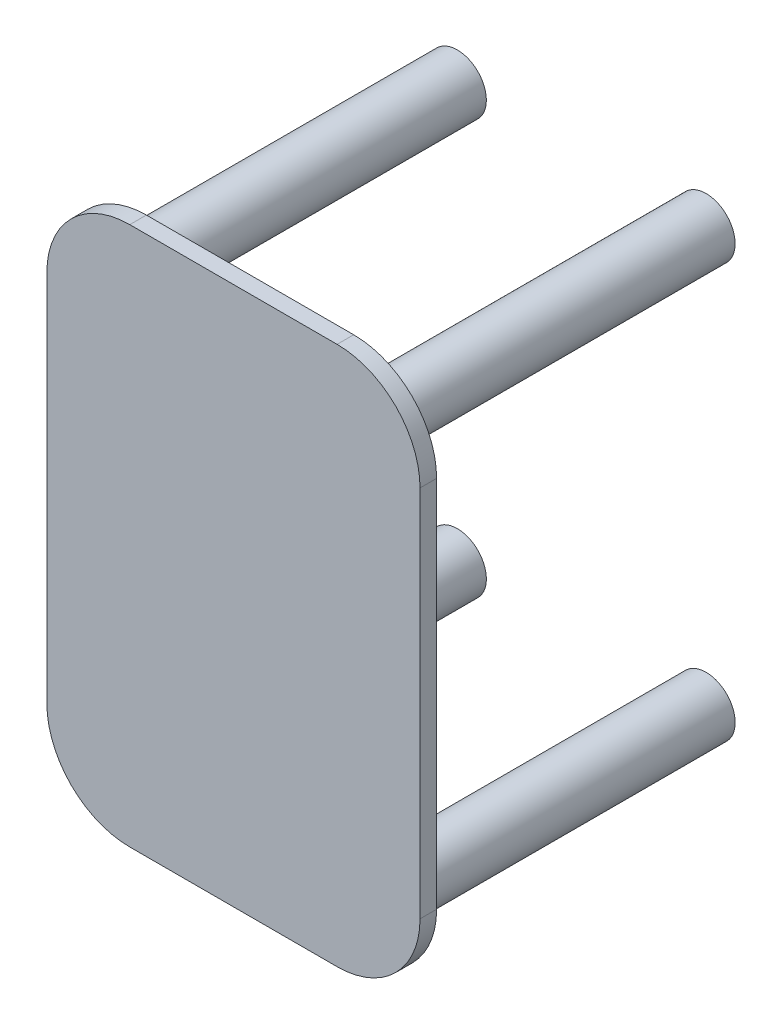
ISO-10303-21;
HEADER;
FILE_DESCRIPTION(('STEP AP214'),'2;1');
FILE_NAME('part.step','',(''),(''),'','','');
FILE_SCHEMA(('AUTOMOTIVE_DESIGN { 1 0 10303 214 1 1 1 1 }'));
ENDSEC;
DATA;
#1=APPLICATION_CONTEXT('core data for automotive mechanical design processes');
#2=APPLICATION_PROTOCOL_DEFINITION('international standard','automotive_design',2000,#1);
#3=PRODUCT_CONTEXT('',#1,'mechanical');
#4=PRODUCT('Part','Part','',(#3));
#5=PRODUCT_RELATED_PRODUCT_CATEGORY('part','',(#4));
#6=PRODUCT_DEFINITION_FORMATION('','',#4);
#7=PRODUCT_DEFINITION_CONTEXT('part definition',#1,'design');
#8=PRODUCT_DEFINITION('design','',#6,#7);
#9=PRODUCT_DEFINITION_SHAPE('','',#8);
#10=(LENGTH_UNIT() NAMED_UNIT(*) SI_UNIT(.MILLI.,.METRE.));
#11=(NAMED_UNIT(*) PLANE_ANGLE_UNIT() SI_UNIT($,.RADIAN.));
#12=(NAMED_UNIT(*) SI_UNIT($,.STERADIAN.) SOLID_ANGLE_UNIT());
#13=UNCERTAINTY_MEASURE_WITH_UNIT(LENGTH_MEASURE(1.E-05),#10,'distance_accuracy_value','');
#14=(GEOMETRIC_REPRESENTATION_CONTEXT(3) GLOBAL_UNCERTAINTY_ASSIGNED_CONTEXT((#13)) GLOBAL_UNIT_ASSIGNED_CONTEXT((#10,
#11,#12)) REPRESENTATION_CONTEXT('',''));
#15=CARTESIAN_POINT('',(0.,0.,0.));
#16=DIRECTION('',(0.,0.,1.));
#17=DIRECTION('',(1.,0.,0.));
#18=AXIS2_PLACEMENT_3D('',#15,#16,#17);
#19=CARTESIAN_POINT('',(-0.125,-0.225,0.42));
#20=DIRECTION('',(0.,0.,-1.));
#21=DIRECTION('',(-1.,0.,0.));
#22=AXIS2_PLACEMENT_3D('',#19,#20,#21);
#23=CYLINDRICAL_SURFACE('',#22,0.1);
#24=CARTESIAN_POINT('',(-0.125,-0.225,0.4));
#25=DIRECTION('',(0.,0.,1.));
#26=DIRECTION('',(1.,0.,0.));
#27=AXIS2_PLACEMENT_3D('',#24,#25,#26);
#28=CIRCLE('',#27,0.1);
#29=CARTESIAN_POINT('',(-0.225,-0.225,0.4));
#30=VERTEX_POINT('',#29);
#31=CARTESIAN_POINT('',(-0.125,-0.325,0.4));
#32=VERTEX_POINT('',#31);
#33=EDGE_CURVE('E138',#30,#32,#28,.T.);
#34=ORIENTED_EDGE('',*,*,#33,.T.);
#35=DIRECTION('',(0.,0.,-1.));
#36=VECTOR('',#35,1.);
#37=CARTESIAN_POINT('',(-0.125,-0.325,0.42));
#38=LINE('',#37,#36);
#39=CARTESIAN_POINT('',(-0.125,-0.325,0.42));
#40=VERTEX_POINT('',#39);
#41=EDGE_CURVE('E12',#40,#32,#38,.T.);
#42=ORIENTED_EDGE('',*,*,#41,.F.);
#43=CARTESIAN_POINT('',(-0.125,-0.225,0.42));
#44=DIRECTION('',(0.,0.,1.));
#45=DIRECTION('',(1.,0.,0.));
#46=AXIS2_PLACEMENT_3D('',#43,#44,#45);
#47=CIRCLE('',#46,0.1);
#48=CARTESIAN_POINT('',(-0.225,-0.225,0.42));
#49=VERTEX_POINT('',#48);
#50=EDGE_CURVE('E152',#49,#40,#47,.T.);
#51=ORIENTED_EDGE('',*,*,#50,.F.);
#52=DIRECTION('',(0.,0.,-1.));
#53=VECTOR('',#52,1.);
#54=CARTESIAN_POINT('',(-0.225,-0.225,0.42));
#55=LINE('',#54,#53);
#56=EDGE_CURVE('E134',#49,#30,#55,.T.);
#57=ORIENTED_EDGE('',*,*,#56,.T.);
#58=EDGE_LOOP('',(#34,#42,#51,#57));
#59=FACE_BOUND('',#58,.T.);
#60=ADVANCED_FACE('F42',(#59),#23,.T.);
#61=CARTESIAN_POINT('',(-0.125,-0.325,0.42));
#62=DIRECTION('',(0.,1.,0.));
#63=DIRECTION('',(0.,0.,1.));
#64=AXIS2_PLACEMENT_3D('',#61,#62,#63);
#65=PLANE('',#64);
#66=DIRECTION('',(1.,0.,0.));
#67=VECTOR('',#66,1.);
#68=CARTESIAN_POINT('',(-0.125,-0.325,0.4));
#69=LINE('',#68,#67);
#70=CARTESIAN_POINT('',(0.125,-0.325,0.4));
#71=VERTEX_POINT('',#70);
#72=EDGE_CURVE('E141',#32,#71,#69,.T.);
#73=ORIENTED_EDGE('',*,*,#72,.T.);
#74=DIRECTION('',(0.,0.,-1.));
#75=VECTOR('',#74,1.);
#76=CARTESIAN_POINT('',(0.125,-0.325,0.42));
#77=LINE('',#76,#75);
#78=CARTESIAN_POINT('',(0.125,-0.325,0.42));
#79=VERTEX_POINT('',#78);
#80=EDGE_CURVE('E50',#79,#71,#77,.T.);
#81=ORIENTED_EDGE('',*,*,#80,.F.);
#82=DIRECTION('',(1.,0.,0.));
#83=VECTOR('',#82,1.);
#84=CARTESIAN_POINT('',(-0.125,-0.325,0.42));
#85=LINE('',#84,#83);
#86=EDGE_CURVE('E101',#40,#79,#85,.T.);
#87=ORIENTED_EDGE('',*,*,#86,.F.);
#88=ORIENTED_EDGE('',*,*,#41,.T.);
#89=EDGE_LOOP('',(#73,#81,#87,#88));
#90=FACE_BOUND('',#89,.T.);
#91=ADVANCED_FACE('F187',(#90),#65,.F.);
#92=CARTESIAN_POINT('',(0.125,-0.225,0.42));
#93=DIRECTION('',(0.,0.,-1.));
#94=DIRECTION('',(-1.,0.,0.));
#95=AXIS2_PLACEMENT_3D('',#92,#93,#94);
#96=CYLINDRICAL_SURFACE('',#95,0.1);
#97=CARTESIAN_POINT('',(0.125,-0.225,0.4));
#98=DIRECTION('',(0.,0.,1.));
#99=DIRECTION('',(1.,0.,0.));
#100=AXIS2_PLACEMENT_3D('',#97,#98,#99);
#101=CIRCLE('',#100,0.1);
#102=CARTESIAN_POINT('',(0.225,-0.225,0.4));
#103=VERTEX_POINT('',#102);
#104=EDGE_CURVE('E143',#71,#103,#101,.T.);
#105=ORIENTED_EDGE('',*,*,#104,.T.);
#106=DIRECTION('',(0.,0.,-1.));
#107=VECTOR('',#106,1.);
#108=CARTESIAN_POINT('',(0.225,-0.225,0.42));
#109=LINE('',#108,#107);
#110=CARTESIAN_POINT('',(0.225,-0.225,0.42));
#111=VERTEX_POINT('',#110);
#112=EDGE_CURVE('E159',#111,#103,#109,.T.);
#113=ORIENTED_EDGE('',*,*,#112,.F.);
#114=CARTESIAN_POINT('',(0.125,-0.225,0.42));
#115=DIRECTION('',(0.,0.,1.));
#116=DIRECTION('',(1.,0.,0.));
#117=AXIS2_PLACEMENT_3D('',#114,#115,#116);
#118=CIRCLE('',#117,0.1);
#119=EDGE_CURVE('E167',#79,#111,#118,.T.);
#120=ORIENTED_EDGE('',*,*,#119,.F.);
#121=ORIENTED_EDGE('',*,*,#80,.T.);
#122=EDGE_LOOP('',(#105,#113,#120,#121));
#123=FACE_BOUND('',#122,.T.);
#124=ADVANCED_FACE('F165',(#123),#96,.T.);
#125=CARTESIAN_POINT('',(0.225,-0.225,0.42));
#126=DIRECTION('',(-1.,0.,0.));
#127=DIRECTION('',(0.,0.,1.));
#128=AXIS2_PLACEMENT_3D('',#125,#126,#127);
#129=PLANE('',#128);
#130=DIRECTION('',(0.,1.,0.));
#131=VECTOR('',#130,1.);
#132=CARTESIAN_POINT('',(0.225,-0.225,0.4));
#133=LINE('',#132,#131);
#134=CARTESIAN_POINT('',(0.225,0.225,0.4));
#135=VERTEX_POINT('',#134);
#136=EDGE_CURVE('E145',#103,#135,#133,.T.);
#137=ORIENTED_EDGE('',*,*,#136,.T.);
#138=DIRECTION('',(0.,0.,-1.));
#139=VECTOR('',#138,1.);
#140=CARTESIAN_POINT('',(0.225,0.225,0.42));
#141=LINE('',#140,#139);
#142=CARTESIAN_POINT('',(0.225,0.225,0.42));
#143=VERTEX_POINT('',#142);
#144=EDGE_CURVE('E156',#143,#135,#141,.T.);
#145=ORIENTED_EDGE('',*,*,#144,.F.);
#146=DIRECTION('',(0.,1.,0.));
#147=VECTOR('',#146,1.);
#148=CARTESIAN_POINT('',(0.225,-0.225,0.42));
#149=LINE('',#148,#147);
#150=EDGE_CURVE('E179',#111,#143,#149,.T.);
#151=ORIENTED_EDGE('',*,*,#150,.F.);
#152=ORIENTED_EDGE('',*,*,#112,.T.);
#153=EDGE_LOOP('',(#137,#145,#151,#152));
#154=FACE_BOUND('',#153,.T.);
#155=ADVANCED_FACE('F175',(#154),#129,.F.);
#156=CARTESIAN_POINT('',(0.125,0.225,0.42));
#157=DIRECTION('',(0.,0.,-1.));
#158=DIRECTION('',(-1.,0.,0.));
#159=AXIS2_PLACEMENT_3D('',#156,#157,#158);
#160=CYLINDRICAL_SURFACE('',#159,0.1);
#161=CARTESIAN_POINT('',(0.125,0.225,0.4));
#162=DIRECTION('',(0.,0.,1.));
#163=DIRECTION('',(1.,0.,0.));
#164=AXIS2_PLACEMENT_3D('',#161,#162,#163);
#165=CIRCLE('',#164,0.1);
#166=CARTESIAN_POINT('',(0.125,0.325,0.4));
#167=VERTEX_POINT('',#166);
#168=EDGE_CURVE('E147',#135,#167,#165,.T.);
#169=ORIENTED_EDGE('',*,*,#168,.T.);
#170=DIRECTION('',(0.,0.,-1.));
#171=VECTOR('',#170,1.);
#172=CARTESIAN_POINT('',(0.125,0.325,0.42));
#173=LINE('',#172,#171);
#174=CARTESIAN_POINT('',(0.125,0.325,0.42));
#175=VERTEX_POINT('',#174);
#176=EDGE_CURVE('E129',#175,#167,#173,.T.);
#177=ORIENTED_EDGE('',*,*,#176,.F.);
#178=CARTESIAN_POINT('',(0.125,0.225,0.42));
#179=DIRECTION('',(0.,0.,1.));
#180=DIRECTION('',(1.,0.,0.));
#181=AXIS2_PLACEMENT_3D('',#178,#179,#180);
#182=CIRCLE('',#181,0.1);
#183=EDGE_CURVE('E120',#143,#175,#182,.T.);
#184=ORIENTED_EDGE('',*,*,#183,.F.);
#185=ORIENTED_EDGE('',*,*,#144,.T.);
#186=EDGE_LOOP('',(#169,#177,#184,#185));
#187=FACE_BOUND('',#186,.T.);
#188=ADVANCED_FACE('F178',(#187),#160,.T.);
#189=CARTESIAN_POINT('',(-0.125,0.325,0.42));
#190=DIRECTION('',(0.,-1.,0.));
#191=DIRECTION('',(0.,0.,-1.));
#192=AXIS2_PLACEMENT_3D('',#189,#190,#191);
#193=PLANE('',#192);
#194=DIRECTION('',(-1.,0.,0.));
#195=VECTOR('',#194,1.);
#196=CARTESIAN_POINT('',(-0.125,0.325,0.4));
#197=LINE('',#196,#195);
#198=CARTESIAN_POINT('',(-0.125,0.325,0.4));
#199=VERTEX_POINT('',#198);
#200=EDGE_CURVE('E128',#167,#199,#197,.T.);
#201=ORIENTED_EDGE('',*,*,#200,.T.);
#202=DIRECTION('',(0.,0.,-1.));
#203=VECTOR('',#202,1.);
#204=CARTESIAN_POINT('',(-0.125,0.325,0.42));
#205=LINE('',#204,#203);
#206=CARTESIAN_POINT('',(-0.125,0.325,0.42));
#207=VERTEX_POINT('',#206);
#208=EDGE_CURVE('E125',#207,#199,#205,.T.);
#209=ORIENTED_EDGE('',*,*,#208,.F.);
#210=DIRECTION('',(-1.,0.,0.));
#211=VECTOR('',#210,1.);
#212=CARTESIAN_POINT('',(-0.125,0.325,0.42));
#213=LINE('',#212,#211);
#214=EDGE_CURVE('E114',#175,#207,#213,.T.);
#215=ORIENTED_EDGE('',*,*,#214,.F.);
#216=ORIENTED_EDGE('',*,*,#176,.T.);
#217=EDGE_LOOP('',(#201,#209,#215,#216));
#218=FACE_BOUND('',#217,.T.);
#219=ADVANCED_FACE('F126',(#218),#193,.F.);
#220=CARTESIAN_POINT('',(-0.125,0.225,0.42));
#221=DIRECTION('',(0.,0.,-1.));
#222=DIRECTION('',(-1.,0.,0.));
#223=AXIS2_PLACEMENT_3D('',#220,#221,#222);
#224=CYLINDRICAL_SURFACE('',#223,0.1);
#225=CARTESIAN_POINT('',(-0.125,0.225,0.4));
#226=DIRECTION('',(0.,0.,1.));
#227=DIRECTION('',(1.,0.,0.));
#228=AXIS2_PLACEMENT_3D('',#225,#226,#227);
#229=CIRCLE('',#228,0.1);
#230=CARTESIAN_POINT('',(-0.225,0.225,0.4));
#231=VERTEX_POINT('',#230);
#232=EDGE_CURVE('E87',#199,#231,#229,.T.);
#233=ORIENTED_EDGE('',*,*,#232,.T.);
#234=DIRECTION('',(0.,0.,-1.));
#235=VECTOR('',#234,1.);
#236=CARTESIAN_POINT('',(-0.225,0.225,0.42));
#237=LINE('',#236,#235);
#238=CARTESIAN_POINT('',(-0.225,0.225,0.42));
#239=VERTEX_POINT('',#238);
#240=EDGE_CURVE('E130',#239,#231,#237,.T.);
#241=ORIENTED_EDGE('',*,*,#240,.F.);
#242=CARTESIAN_POINT('',(-0.125,0.225,0.42));
#243=DIRECTION('',(0.,0.,1.));
#244=DIRECTION('',(1.,0.,0.));
#245=AXIS2_PLACEMENT_3D('',#242,#243,#244);
#246=CIRCLE('',#245,0.1);
#247=EDGE_CURVE('E118',#207,#239,#246,.T.);
#248=ORIENTED_EDGE('',*,*,#247,.F.);
#249=ORIENTED_EDGE('',*,*,#208,.T.);
#250=EDGE_LOOP('',(#233,#241,#248,#249));
#251=FACE_BOUND('',#250,.T.);
#252=ADVANCED_FACE('F132',(#251),#224,.T.);
#253=CARTESIAN_POINT('',(-0.225,-0.225,0.42));
#254=DIRECTION('',(1.,0.,0.));
#255=DIRECTION('',(0.,0.,-1.));
#256=AXIS2_PLACEMENT_3D('',#253,#254,#255);
#257=PLANE('',#256);
#258=DIRECTION('',(0.,-1.,0.));
#259=VECTOR('',#258,1.);
#260=CARTESIAN_POINT('',(-0.225,-0.225,0.4));
#261=LINE('',#260,#259);
#262=EDGE_CURVE('E93',#231,#30,#261,.T.);
#263=ORIENTED_EDGE('',*,*,#262,.T.);
#264=ORIENTED_EDGE('',*,*,#56,.F.);
#265=DIRECTION('',(0.,-1.,0.));
#266=VECTOR('',#265,1.);
#267=CARTESIAN_POINT('',(-0.225,-0.225,0.42));
#268=LINE('',#267,#266);
#269=EDGE_CURVE('E58',#239,#49,#268,.T.);
#270=ORIENTED_EDGE('',*,*,#269,.F.);
#271=ORIENTED_EDGE('',*,*,#240,.T.);
#272=EDGE_LOOP('',(#263,#264,#270,#271));
#273=FACE_BOUND('',#272,.T.);
#274=ADVANCED_FACE('F203',(#273),#257,.F.);
#275=CARTESIAN_POINT('',(-0.125,-0.225,0.42));
#276=DIRECTION('',(0.,0.,1.));
#277=DIRECTION('',(1.,0.,0.));
#278=AXIS2_PLACEMENT_3D('',#275,#276,#277);
#279=PLANE('',#278);
#280=ORIENTED_EDGE('',*,*,#50,.T.);
#281=ORIENTED_EDGE('',*,*,#86,.T.);
#282=ORIENTED_EDGE('',*,*,#119,.T.);
#283=ORIENTED_EDGE('',*,*,#150,.T.);
#284=ORIENTED_EDGE('',*,*,#183,.T.);
#285=ORIENTED_EDGE('',*,*,#214,.T.);
#286=ORIENTED_EDGE('',*,*,#247,.T.);
#287=ORIENTED_EDGE('',*,*,#269,.T.);
#288=EDGE_LOOP('',(#280,#281,#282,#283,#284,#285,#286,#287));
#289=FACE_BOUND('',#288,.T.);
#290=ADVANCED_FACE('F116',(#289),#279,.T.);
#291=CARTESIAN_POINT('',(-0.125,-0.225,0.4));
#292=DIRECTION('',(0.,0.,1.));
#293=DIRECTION('',(1.,0.,0.));
#294=AXIS2_PLACEMENT_3D('',#291,#292,#293);
#295=PLANE('',#294);
#296=ORIENTED_EDGE('',*,*,#33,.F.);
#297=ORIENTED_EDGE('',*,*,#262,.F.);
#298=ORIENTED_EDGE('',*,*,#232,.F.);
#299=ORIENTED_EDGE('',*,*,#200,.F.);
#300=ORIENTED_EDGE('',*,*,#168,.F.);
#301=ORIENTED_EDGE('',*,*,#136,.F.);
#302=ORIENTED_EDGE('',*,*,#104,.F.);
#303=ORIENTED_EDGE('',*,*,#72,.F.);
#304=EDGE_LOOP('',(#296,#297,#298,#299,#300,#301,#302,#303));
#305=FACE_BOUND('',#304,.T.);
#306=ADVANCED_FACE('F171',(#305),#295,.F.);
#307=CLOSED_SHELL('',(#60,#91,#124,#155,#188,#219,#252,#274,#290,#306));
#308=MANIFOLD_SOLID_BREP('B2',#307);
#309=CARTESIAN_POINT('',(0.15,0.25,0.4));
#310=DIRECTION('',(0.,0.,-1.));
#311=DIRECTION('',(-1.,0.,0.));
#312=AXIS2_PLACEMENT_3D('',#309,#310,#311);
#313=CYLINDRICAL_SURFACE('',#312,0.035);
#314=CARTESIAN_POINT('',(0.15,0.25,0.4));
#315=DIRECTION('',(0.,0.,1.));
#316=DIRECTION('',(-1.,0.,0.));
#317=AXIS2_PLACEMENT_3D('',#314,#315,#316);
#318=CIRCLE('',#317,0.035);
#319=CARTESIAN_POINT('',(0.115,0.25,0.4));
#320=VERTEX_POINT('',#319);
#321=EDGE_CURVE('E41',#320,#320,#318,.T.);
#322=ORIENTED_EDGE('',*,*,#321,.F.);
#323=EDGE_LOOP('',(#322));
#324=FACE_BOUND('',#323,.T.);
#325=CARTESIAN_POINT('',(0.15,0.25,0.));
#326=DIRECTION('',(0.,0.,1.));
#327=DIRECTION('',(-1.,0.,0.));
#328=AXIS2_PLACEMENT_3D('',#325,#326,#327);
#329=CIRCLE('',#328,0.035);
#330=CARTESIAN_POINT('',(0.115,0.25,0.));
#331=VERTEX_POINT('',#330);
#332=EDGE_CURVE('E281',#331,#331,#329,.T.);
#333=ORIENTED_EDGE('',*,*,#332,.T.);
#334=EDGE_LOOP('',(#333));
#335=FACE_BOUND('',#334,.T.);
#336=ADVANCED_FACE('F278',(#324,#335),#313,.T.);
#337=CARTESIAN_POINT('',(0.15,0.25,0.4));
#338=DIRECTION('',(0.,0.,-1.));
#339=DIRECTION('',(-1.,0.,0.));
#340=AXIS2_PLACEMENT_3D('',#337,#338,#339);
#341=PLANE('',#340);
#342=ORIENTED_EDGE('',*,*,#321,.T.);
#343=EDGE_LOOP('',(#342));
#344=FACE_BOUND('',#343,.T.);
#345=ADVANCED_FACE('F293',(#344),#341,.F.);
#346=CARTESIAN_POINT('',(0.15,0.25,0.));
#347=DIRECTION('',(0.,0.,-1.));
#348=DIRECTION('',(-1.,0.,0.));
#349=AXIS2_PLACEMENT_3D('',#346,#347,#348);
#350=PLANE('',#349);
#351=ORIENTED_EDGE('',*,*,#332,.F.);
#352=EDGE_LOOP('',(#351));
#353=FACE_BOUND('',#352,.T.);
#354=ADVANCED_FACE('F291',(#353),#350,.T.);
#355=CLOSED_SHELL('',(#336,#345,#354));
#356=MANIFOLD_SOLID_BREP('B6',#355);
#357=CARTESIAN_POINT('',(0.15,-0.25,0.4));
#358=DIRECTION('',(0.,0.,-1.));
#359=DIRECTION('',(-1.,0.,0.));
#360=AXIS2_PLACEMENT_3D('',#357,#358,#359);
#361=CYLINDRICAL_SURFACE('',#360,0.035);
#362=CARTESIAN_POINT('',(0.15,-0.25,0.4));
#363=DIRECTION('',(0.,0.,1.));
#364=DIRECTION('',(1.,0.,0.));
#365=AXIS2_PLACEMENT_3D('',#362,#363,#364);
#366=CIRCLE('',#365,0.035);
#367=CARTESIAN_POINT('',(0.185,-0.25,0.4));
#368=VERTEX_POINT('',#367);
#369=EDGE_CURVE('E277',#368,#368,#366,.T.);
#370=ORIENTED_EDGE('',*,*,#369,.F.);
#371=EDGE_LOOP('',(#370));
#372=FACE_BOUND('',#371,.T.);
#373=CARTESIAN_POINT('',(0.15,-0.25,0.));
#374=DIRECTION('',(0.,0.,1.));
#375=DIRECTION('',(1.,0.,0.));
#376=AXIS2_PLACEMENT_3D('',#373,#374,#375);
#377=CIRCLE('',#376,0.035);
#378=CARTESIAN_POINT('',(0.185,-0.25,0.));
#379=VERTEX_POINT('',#378);
#380=EDGE_CURVE('E330',#379,#379,#377,.T.);
#381=ORIENTED_EDGE('',*,*,#380,.T.);
#382=EDGE_LOOP('',(#381));
#383=FACE_BOUND('',#382,.T.);
#384=ADVANCED_FACE('F327',(#372,#383),#361,.T.);
#385=CARTESIAN_POINT('',(0.15,-0.25,0.4));
#386=DIRECTION('',(0.,0.,1.));
#387=DIRECTION('',(1.,0.,0.));
#388=AXIS2_PLACEMENT_3D('',#385,#386,#387);
#389=PLANE('',#388);
#390=ORIENTED_EDGE('',*,*,#369,.T.);
#391=EDGE_LOOP('',(#390));
#392=FACE_BOUND('',#391,.T.);
#393=ADVANCED_FACE('F342',(#392),#389,.T.);
#394=CARTESIAN_POINT('',(0.15,-0.25,0.));
#395=DIRECTION('',(0.,0.,1.));
#396=DIRECTION('',(1.,0.,0.));
#397=AXIS2_PLACEMENT_3D('',#394,#395,#396);
#398=PLANE('',#397);
#399=ORIENTED_EDGE('',*,*,#380,.F.);
#400=EDGE_LOOP('',(#399));
#401=FACE_BOUND('',#400,.T.);
#402=ADVANCED_FACE('F340',(#401),#398,.F.);
#403=CLOSED_SHELL('',(#384,#393,#402));
#404=MANIFOLD_SOLID_BREP('B36',#403);
#405=CARTESIAN_POINT('',(-0.15,-0.25,0.4));
#406=DIRECTION('',(0.,0.,-1.));
#407=DIRECTION('',(-1.,0.,0.));
#408=AXIS2_PLACEMENT_3D('',#405,#406,#407);
#409=CYLINDRICAL_SURFACE('',#408,0.035);
#410=CARTESIAN_POINT('',(-0.15,-0.25,0.4));
#411=DIRECTION('',(0.,0.,1.));
#412=DIRECTION('',(-1.,0.,0.));
#413=AXIS2_PLACEMENT_3D('',#410,#411,#412);
#414=CIRCLE('',#413,0.035);
#415=CARTESIAN_POINT('',(-0.185,-0.25,0.4));
#416=VERTEX_POINT('',#415);
#417=EDGE_CURVE('E326',#416,#416,#414,.T.);
#418=ORIENTED_EDGE('',*,*,#417,.F.);
#419=EDGE_LOOP('',(#418));
#420=FACE_BOUND('',#419,.T.);
#421=CARTESIAN_POINT('',(-0.15,-0.25,0.));
#422=DIRECTION('',(0.,0.,1.));
#423=DIRECTION('',(-1.,0.,0.));
#424=AXIS2_PLACEMENT_3D('',#421,#422,#423);
#425=CIRCLE('',#424,0.035);
#426=CARTESIAN_POINT('',(-0.185,-0.25,0.));
#427=VERTEX_POINT('',#426);
#428=EDGE_CURVE('E378',#427,#427,#425,.T.);
#429=ORIENTED_EDGE('',*,*,#428,.T.);
#430=EDGE_LOOP('',(#429));
#431=FACE_BOUND('',#430,.T.);
#432=ADVANCED_FACE('F375',(#420,#431),#409,.T.);
#433=CARTESIAN_POINT('',(-0.15,-0.25,0.4));
#434=DIRECTION('',(0.,0.,-1.));
#435=DIRECTION('',(-1.,0.,0.));
#436=AXIS2_PLACEMENT_3D('',#433,#434,#435);
#437=PLANE('',#436);
#438=ORIENTED_EDGE('',*,*,#417,.T.);
#439=EDGE_LOOP('',(#438));
#440=FACE_BOUND('',#439,.T.);
#441=ADVANCED_FACE('F390',(#440),#437,.F.);
#442=CARTESIAN_POINT('',(-0.15,-0.25,0.));
#443=DIRECTION('',(0.,0.,-1.));
#444=DIRECTION('',(-1.,0.,0.));
#445=AXIS2_PLACEMENT_3D('',#442,#443,#444);
#446=PLANE('',#445);
#447=ORIENTED_EDGE('',*,*,#428,.F.);
#448=EDGE_LOOP('',(#447));
#449=FACE_BOUND('',#448,.T.);
#450=ADVANCED_FACE('F388',(#449),#446,.T.);
#451=CLOSED_SHELL('',(#432,#441,#450));
#452=MANIFOLD_SOLID_BREP('B272',#451);
#453=CARTESIAN_POINT('',(-0.15,0.25,0.4));
#454=DIRECTION('',(0.,0.,-1.));
#455=DIRECTION('',(-1.,0.,0.));
#456=AXIS2_PLACEMENT_3D('',#453,#454,#455);
#457=CYLINDRICAL_SURFACE('',#456,0.035);
#458=CARTESIAN_POINT('',(-0.15,0.25,0.4));
#459=DIRECTION('',(0.,0.,1.));
#460=DIRECTION('',(1.,0.,0.));
#461=AXIS2_PLACEMENT_3D('',#458,#459,#460);
#462=CIRCLE('',#461,0.035);
#463=CARTESIAN_POINT('',(-0.115,0.25,0.4));
#464=VERTEX_POINT('',#463);
#465=EDGE_CURVE('E374',#464,#464,#462,.T.);
#466=ORIENTED_EDGE('',*,*,#465,.F.);
#467=EDGE_LOOP('',(#466));
#468=FACE_BOUND('',#467,.T.);
#469=CARTESIAN_POINT('',(-0.15,0.25,0.));
#470=DIRECTION('',(0.,0.,1.));
#471=DIRECTION('',(1.,0.,0.));
#472=AXIS2_PLACEMENT_3D('',#469,#470,#471);
#473=CIRCLE('',#472,0.035);
#474=CARTESIAN_POINT('',(-0.115,0.25,0.));
#475=VERTEX_POINT('',#474);
#476=EDGE_CURVE('E419',#475,#475,#473,.T.);
#477=ORIENTED_EDGE('',*,*,#476,.T.);
#478=EDGE_LOOP('',(#477));
#479=FACE_BOUND('',#478,.T.);
#480=ADVANCED_FACE('F416',(#468,#479),#457,.T.);
#481=CARTESIAN_POINT('',(-0.15,0.25,0.4));
#482=DIRECTION('',(0.,0.,1.));
#483=DIRECTION('',(1.,0.,0.));
#484=AXIS2_PLACEMENT_3D('',#481,#482,#483);
#485=PLANE('',#484);
#486=ORIENTED_EDGE('',*,*,#465,.T.);
#487=EDGE_LOOP('',(#486));
#488=FACE_BOUND('',#487,.T.);
#489=ADVANCED_FACE('F431',(#488),#485,.T.);
#490=CARTESIAN_POINT('',(-0.15,0.25,0.));
#491=DIRECTION('',(0.,0.,1.));
#492=DIRECTION('',(1.,0.,0.));
#493=AXIS2_PLACEMENT_3D('',#490,#491,#492);
#494=PLANE('',#493);
#495=ORIENTED_EDGE('',*,*,#476,.F.);
#496=EDGE_LOOP('',(#495));
#497=FACE_BOUND('',#496,.T.);
#498=ADVANCED_FACE('F429',(#497),#494,.F.);
#499=CLOSED_SHELL('',(#480,#489,#498));
#500=MANIFOLD_SOLID_BREP('B321',#499);
#501=ADVANCED_BREP_SHAPE_REPRESENTATION('',(#18,#308,#356,#404,#452,#500),#14);
#502=SHAPE_DEFINITION_REPRESENTATION(#9,#501);
ENDSEC;
END-ISO-10303-21;
